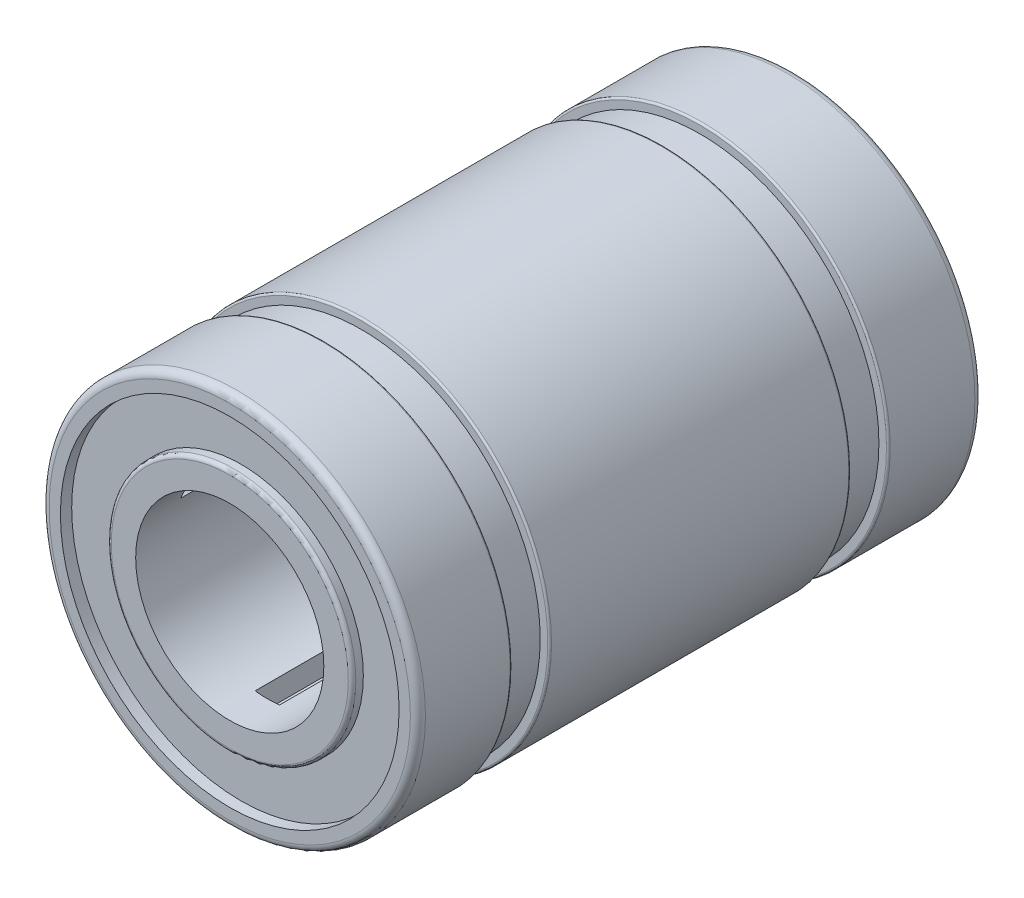
ISO-10303-21;
HEADER;
FILE_DESCRIPTION(('STEP AP214'),'2;1');
FILE_NAME('part.step','',(''),(''),'','','');
FILE_SCHEMA(('AUTOMOTIVE_DESIGN { 1 0 10303 214 1 1 1 1 }'));
ENDSEC;
DATA;
#1=APPLICATION_CONTEXT('core data for automotive mechanical design processes');
#2=APPLICATION_PROTOCOL_DEFINITION('international standard','automotive_design',2000,#1);
#3=PRODUCT_CONTEXT('',#1,'mechanical');
#4=PRODUCT('Part','Part','',(#3));
#5=PRODUCT_RELATED_PRODUCT_CATEGORY('part','',(#4));
#6=PRODUCT_DEFINITION_FORMATION('','',#4);
#7=PRODUCT_DEFINITION_CONTEXT('part definition',#1,'design');
#8=PRODUCT_DEFINITION('design','',#6,#7);
#9=PRODUCT_DEFINITION_SHAPE('','',#8);
#10=(LENGTH_UNIT() NAMED_UNIT(*) SI_UNIT(.MILLI.,.METRE.));
#11=(NAMED_UNIT(*) PLANE_ANGLE_UNIT() SI_UNIT($,.RADIAN.));
#12=(NAMED_UNIT(*) SI_UNIT($,.STERADIAN.) SOLID_ANGLE_UNIT());
#13=UNCERTAINTY_MEASURE_WITH_UNIT(LENGTH_MEASURE(1.E-05),#10,'distance_accuracy_value','');
#14=(GEOMETRIC_REPRESENTATION_CONTEXT(3) GLOBAL_UNCERTAINTY_ASSIGNED_CONTEXT((#13)) GLOBAL_UNIT_ASSIGNED_CONTEXT((#10,
#11,#12)) REPRESENTATION_CONTEXT('',''));
#15=CARTESIAN_POINT('',(0.,0.,0.));
#16=DIRECTION('',(0.,0.,1.));
#17=DIRECTION('',(1.,0.,0.));
#18=AXIS2_PLACEMENT_3D('',#15,#16,#17);
#19=CARTESIAN_POINT('',(-1.83838215350508,0.686207822560546,6.5));
#20=DIRECTION('',(-0.499999999999992,-0.866025403784443,0.));
#21=DIRECTION('',(0.866025403784443,-0.499999999999992,0.));
#22=AXIS2_PLACEMENT_3D('',#19,#20,#21);
#23=PLANE('',#22);
#24=DIRECTION('',(0.866025403784443,-0.499999999999992,0.));
#25=VECTOR('',#24,1.);
#26=CARTESIAN_POINT('',(-1.83838215350508,0.686207822560546,-6.5));
#27=LINE('',#26,#25);
#28=CARTESIAN_POINT('',(-2.81666253555662,1.25101826448092,-6.5));
#29=VERTEX_POINT('',#28);
#30=CARTESIAN_POINT('',(-2.30915894936689,0.958010932379585,-6.5));
#31=VERTEX_POINT('',#30);
#32=EDGE_CURVE('E175',#29,#31,#27,.T.);
#33=ORIENTED_EDGE('',*,*,#32,.F.);
#34=DIRECTION('',(0.,0.,-1.));
#35=VECTOR('',#34,1.);
#36=CARTESIAN_POINT('',(-2.81666253555662,1.25101826448092,6.5));
#37=LINE('',#36,#35);
#38=CARTESIAN_POINT('',(-2.81666253555662,1.25101826448092,6.5));
#39=VERTEX_POINT('',#38);
#40=EDGE_CURVE('E161',#39,#29,#37,.T.);
#41=ORIENTED_EDGE('',*,*,#40,.F.);
#42=DIRECTION('',(-0.866025403784443,0.499999999999992,0.));
#43=VECTOR('',#42,1.);
#44=CARTESIAN_POINT('',(-1.83838215350508,0.686207822560546,6.5));
#45=LINE('',#44,#43);
#46=CARTESIAN_POINT('',(-2.30915894936689,0.958010932379585,6.5));
#47=VERTEX_POINT('',#46);
#48=EDGE_CURVE('E177',#47,#39,#45,.T.);
#49=ORIENTED_EDGE('',*,*,#48,.F.);
#50=DIRECTION('',(0.,0.,-1.));
#51=VECTOR('',#50,1.);
#52=CARTESIAN_POINT('',(-2.30915894936689,0.958010932379585,12.8));
#53=LINE('',#52,#51);
#54=EDGE_CURVE('E53',#31,#47,#53,.F.);
#55=ORIENTED_EDGE('',*,*,#54,.F.);
#56=EDGE_LOOP('',(#33,#41,#49,#55));
#57=FACE_BOUND('',#56,.T.);
#58=ADVANCED_FACE('F38',(#57),#23,.F.);
#59=CARTESIAN_POINT('',(-1.5134644833656,1.24898173551904,6.5));
#60=DIRECTION('',(0.499999999999992,0.866025403784443,0.));
#61=DIRECTION('',(-0.866025403784443,0.499999999999992,0.));
#62=AXIS2_PLACEMENT_3D('',#59,#60,#61);
#63=PLANE('',#62);
#64=DIRECTION('',(-0.866025403784443,0.499999999999992,0.));
#65=VECTOR('',#64,1.);
#66=CARTESIAN_POINT('',(-1.5134644833656,1.24898173551904,-6.5));
#67=LINE('',#66,#65);
#68=CARTESIAN_POINT('',(-1.98424127922741,1.52078484533808,-6.5));
#69=VERTEX_POINT('',#68);
#70=CARTESIAN_POINT('',(-2.49174486541714,1.81379217743941,-6.5));
#71=VERTEX_POINT('',#70);
#72=EDGE_CURVE('E61',#69,#71,#67,.T.);
#73=ORIENTED_EDGE('',*,*,#72,.F.);
#74=DIRECTION('',(0.,0.,-1.));
#75=VECTOR('',#74,1.);
#76=CARTESIAN_POINT('',(-1.98424127922741,1.52078484533808,12.8));
#77=LINE('',#76,#75);
#78=CARTESIAN_POINT('',(-1.98424127922741,1.52078484533808,6.5));
#79=VERTEX_POINT('',#78);
#80=EDGE_CURVE('E221',#79,#69,#77,.T.);
#81=ORIENTED_EDGE('',*,*,#80,.F.);
#82=DIRECTION('',(0.866025403784443,-0.499999999999992,0.));
#83=VECTOR('',#82,1.);
#84=CARTESIAN_POINT('',(-1.5134644833656,1.24898173551904,6.5));
#85=LINE('',#84,#83);
#86=CARTESIAN_POINT('',(-2.49174486541714,1.81379217743941,6.5));
#87=VERTEX_POINT('',#86);
#88=EDGE_CURVE('E174',#87,#79,#85,.T.);
#89=ORIENTED_EDGE('',*,*,#88,.F.);
#90=DIRECTION('',(0.,0.,-1.));
#91=VECTOR('',#90,1.);
#92=CARTESIAN_POINT('',(-2.49174486541714,1.81379217743941,6.5));
#93=LINE('',#92,#91);
#94=EDGE_CURVE('E179',#87,#71,#93,.T.);
#95=ORIENTED_EDGE('',*,*,#94,.T.);
#96=EDGE_LOOP('',(#73,#81,#89,#95));
#97=FACE_BOUND('',#96,.T.);
#98=ADVANCED_FACE('F297',(#97),#63,.F.);
#99=CARTESIAN_POINT('',(-2.81666253555662,1.25101826448092,6.5));
#100=DIRECTION('',(-0.866025403784443,0.499999999999992,0.));
#101=DIRECTION('',(-0.499999999999992,-0.866025403784443,0.));
#102=AXIS2_PLACEMENT_3D('',#99,#100,#101);
#103=PLANE('',#102);
#104=DIRECTION('',(-0.499999999999992,-0.866025403784443,0.));
#105=VECTOR('',#104,1.);
#106=CARTESIAN_POINT('',(-2.81666253555662,1.25101826448092,-6.5));
#107=LINE('',#106,#105);
#108=EDGE_CURVE('E744',#71,#29,#107,.T.);
#109=ORIENTED_EDGE('',*,*,#108,.F.);
#110=ORIENTED_EDGE('',*,*,#94,.F.);
#111=DIRECTION('',(0.499999999999992,0.866025403784443,0.));
#112=VECTOR('',#111,1.);
#113=CARTESIAN_POINT('',(-2.81666253555662,1.25101826448092,6.5));
#114=LINE('',#113,#112);
#115=EDGE_CURVE('E171',#39,#87,#114,.T.);
#116=ORIENTED_EDGE('',*,*,#115,.F.);
#117=ORIENTED_EDGE('',*,*,#40,.T.);
#118=EDGE_LOOP('',(#109,#110,#116,#117));
#119=FACE_BOUND('',#118,.T.);
#120=ADVANCED_FACE('F302',(#119),#103,.F.);
#121=CARTESIAN_POINT('',(1.51346448336558,1.24898173551906,6.5));
#122=DIRECTION('',(-0.500000000000004,0.866025403784436,0.));
#123=DIRECTION('',(-0.866025403784436,-0.500000000000004,0.));
#124=AXIS2_PLACEMENT_3D('',#121,#122,#123);
#125=PLANE('',#124);
#126=DIRECTION('',(-0.866025403784436,-0.500000000000004,0.));
#127=VECTOR('',#126,1.);
#128=CARTESIAN_POINT('',(1.51346448336558,1.24898173551906,-6.5));
#129=LINE('',#128,#127);
#130=CARTESIAN_POINT('',(2.49174486541711,1.81379217743945,-6.5));
#131=VERTEX_POINT('',#130);
#132=CARTESIAN_POINT('',(1.98424127922739,1.52078484533811,-6.5));
#133=VERTEX_POINT('',#132);
#134=EDGE_CURVE('E741',#131,#133,#129,.T.);
#135=ORIENTED_EDGE('',*,*,#134,.F.);
#136=DIRECTION('',(0.,0.,-1.));
#137=VECTOR('',#136,1.);
#138=CARTESIAN_POINT('',(2.49174486541711,1.81379217743945,6.5));
#139=LINE('',#138,#137);
#140=CARTESIAN_POINT('',(2.49174486541711,1.81379217743945,6.5));
#141=VERTEX_POINT('',#140);
#142=EDGE_CURVE('E166',#141,#131,#139,.T.);
#143=ORIENTED_EDGE('',*,*,#142,.F.);
#144=DIRECTION('',(0.866025403784436,0.500000000000004,0.));
#145=VECTOR('',#144,1.);
#146=CARTESIAN_POINT('',(1.51346448336558,1.24898173551906,6.5));
#147=LINE('',#146,#145);
#148=CARTESIAN_POINT('',(1.98424127922739,1.52078484533811,6.5));
#149=VERTEX_POINT('',#148);
#150=EDGE_CURVE('E163',#149,#141,#147,.T.);
#151=ORIENTED_EDGE('',*,*,#150,.F.);
#152=DIRECTION('',(0.,0.,-1.));
#153=VECTOR('',#152,1.);
#154=CARTESIAN_POINT('',(1.98424127922739,1.52078484533811,12.8));
#155=LINE('',#154,#153);
#156=EDGE_CURVE('E230',#133,#149,#155,.F.);
#157=ORIENTED_EDGE('',*,*,#156,.F.);
#158=EDGE_LOOP('',(#135,#143,#151,#157));
#159=FACE_BOUND('',#158,.T.);
#160=ADVANCED_FACE('F310',(#159),#125,.F.);
#161=CARTESIAN_POINT('',(1.83838215350507,0.686207822560572,6.5));
#162=DIRECTION('',(0.500000000000004,-0.866025403784436,0.));
#163=DIRECTION('',(0.866025403784436,0.500000000000004,0.));
#164=AXIS2_PLACEMENT_3D('',#161,#162,#163);
#165=PLANE('',#164);
#166=DIRECTION('',(0.866025403784436,0.500000000000004,0.));
#167=VECTOR('',#166,1.);
#168=CARTESIAN_POINT('',(1.83838215350507,0.686207822560572,-6.5));
#169=LINE('',#168,#167);
#170=CARTESIAN_POINT('',(2.30915894936688,0.958010932379617,-6.5));
#171=VERTEX_POINT('',#170);
#172=CARTESIAN_POINT('',(2.8166625355566,1.25101826448096,-6.5));
#173=VERTEX_POINT('',#172);
#174=EDGE_CURVE('E738',#171,#173,#169,.T.);
#175=ORIENTED_EDGE('',*,*,#174,.F.);
#176=DIRECTION('',(0.,0.,-1.));
#177=VECTOR('',#176,1.);
#178=CARTESIAN_POINT('',(2.30915894936688,0.958010932379617,12.8));
#179=LINE('',#178,#177);
#180=CARTESIAN_POINT('',(2.30915894936688,0.958010932379617,6.5));
#181=VERTEX_POINT('',#180);
#182=EDGE_CURVE('E227',#181,#171,#179,.T.);
#183=ORIENTED_EDGE('',*,*,#182,.F.);
#184=DIRECTION('',(-0.866025403784436,-0.500000000000004,0.));
#185=VECTOR('',#184,1.);
#186=CARTESIAN_POINT('',(1.83838215350507,0.686207822560572,6.5));
#187=LINE('',#186,#185);
#188=CARTESIAN_POINT('',(2.8166625355566,1.25101826448096,6.5));
#189=VERTEX_POINT('',#188);
#190=EDGE_CURVE('E160',#189,#181,#187,.T.);
#191=ORIENTED_EDGE('',*,*,#190,.F.);
#192=DIRECTION('',(0.,0.,-1.));
#193=VECTOR('',#192,1.);
#194=CARTESIAN_POINT('',(2.8166625355566,1.25101826448096,6.5));
#195=LINE('',#194,#193);
#196=EDGE_CURVE('E165',#189,#173,#195,.T.);
#197=ORIENTED_EDGE('',*,*,#196,.T.);
#198=EDGE_LOOP('',(#175,#183,#191,#197));
#199=FACE_BOUND('',#198,.T.);
#200=ADVANCED_FACE('F619',(#199),#165,.F.);
#201=CARTESIAN_POINT('',(2.49174486541711,1.81379217743945,6.5));
#202=DIRECTION('',(0.866025403784436,0.500000000000004,0.));
#203=DIRECTION('',(-0.500000000000004,0.866025403784436,0.));
#204=AXIS2_PLACEMENT_3D('',#201,#202,#203);
#205=PLANE('',#204);
#206=DIRECTION('',(-0.500000000000004,0.866025403784436,0.));
#207=VECTOR('',#206,1.);
#208=CARTESIAN_POINT('',(2.49174486541711,1.81379217743945,-6.5));
#209=LINE('',#208,#207);
#210=EDGE_CURVE('E722',#173,#131,#209,.T.);
#211=ORIENTED_EDGE('',*,*,#210,.F.);
#212=ORIENTED_EDGE('',*,*,#196,.F.);
#213=DIRECTION('',(0.500000000000004,-0.866025403784436,0.));
#214=VECTOR('',#213,1.);
#215=CARTESIAN_POINT('',(2.49174486541711,1.81379217743945,6.5));
#216=LINE('',#215,#214);
#217=EDGE_CURVE('E157',#141,#189,#216,.T.);
#218=ORIENTED_EDGE('',*,*,#217,.F.);
#219=ORIENTED_EDGE('',*,*,#142,.T.);
#220=EDGE_LOOP('',(#211,#212,#218,#219));
#221=FACE_BOUND('',#220,.T.);
#222=ADVANCED_FACE('F628',(#221),#205,.F.);
#223=CARTESIAN_POINT('',(-0.324917670139485,-1.93518955807962,6.5));
#224=DIRECTION('',(-1.,0.,0.));
#225=DIRECTION('',(0.,0.,1.));
#226=AXIS2_PLACEMENT_3D('',#223,#224,#225);
#227=PLANE('',#226);
#228=DIRECTION('',(0.,-1.,0.));
#229=VECTOR('',#228,1.);
#230=CARTESIAN_POINT('',(-0.324917670139485,-1.93518955807962,-6.5));
#231=LINE('',#230,#229);
#232=CARTESIAN_POINT('',(-0.324917670139485,-2.47879577771771,-6.5));
#233=VERTEX_POINT('',#232);
#234=CARTESIAN_POINT('',(-0.324917670139485,-3.06481044192038,-6.5));
#235=VERTEX_POINT('',#234);
#236=EDGE_CURVE('E720',#233,#235,#231,.T.);
#237=ORIENTED_EDGE('',*,*,#236,.F.);
#238=DIRECTION('',(0.,0.,-1.));
#239=VECTOR('',#238,1.);
#240=CARTESIAN_POINT('',(-0.324917670139485,-2.47879577771771,12.8));
#241=LINE('',#240,#239);
#242=CARTESIAN_POINT('',(-0.324917670139485,-2.47879577771771,6.5));
#243=VERTEX_POINT('',#242);
#244=EDGE_CURVE('E235',#243,#233,#241,.T.);
#245=ORIENTED_EDGE('',*,*,#244,.F.);
#246=DIRECTION('',(0.,1.,0.));
#247=VECTOR('',#246,1.);
#248=CARTESIAN_POINT('',(-0.324917670139485,-1.93518955807962,6.5));
#249=LINE('',#248,#247);
#250=CARTESIAN_POINT('',(-0.324917670139485,-3.06481044192038,6.5));
#251=VERTEX_POINT('',#250);
#252=EDGE_CURVE('E138',#251,#243,#249,.T.);
#253=ORIENTED_EDGE('',*,*,#252,.F.);
#254=DIRECTION('',(0.,0.,-1.));
#255=VECTOR('',#254,1.);
#256=CARTESIAN_POINT('',(-0.324917670139485,-3.06481044192038,6.5));
#257=LINE('',#256,#255);
#258=EDGE_CURVE('E147',#251,#235,#257,.T.);
#259=ORIENTED_EDGE('',*,*,#258,.T.);
#260=EDGE_LOOP('',(#237,#245,#253,#259));
#261=FACE_BOUND('',#260,.T.);
#262=ADVANCED_FACE('F637',(#261),#227,.F.);
#263=CARTESIAN_POINT('',(0.324917670139485,-1.93518955807962,6.5));
#264=DIRECTION('',(1.,0.,0.));
#265=DIRECTION('',(0.,0.,-1.));
#266=AXIS2_PLACEMENT_3D('',#263,#264,#265);
#267=PLANE('',#266);
#268=DIRECTION('',(0.,1.,0.));
#269=VECTOR('',#268,1.);
#270=CARTESIAN_POINT('',(0.324917670139485,-1.93518955807962,-6.5));
#271=LINE('',#270,#269);
#272=CARTESIAN_POINT('',(0.324917670139485,-3.06481044192038,-6.5));
#273=VERTEX_POINT('',#272);
#274=CARTESIAN_POINT('',(0.324917670139485,-2.47879577771771,-6.5));
#275=VERTEX_POINT('',#274);
#276=EDGE_CURVE('E144',#273,#275,#271,.T.);
#277=ORIENTED_EDGE('',*,*,#276,.F.);
#278=DIRECTION('',(0.,0.,-1.));
#279=VECTOR('',#278,1.);
#280=CARTESIAN_POINT('',(0.324917670139485,-3.06481044192038,6.5));
#281=LINE('',#280,#279);
#282=CARTESIAN_POINT('',(0.324917670139485,-3.06481044192038,6.5));
#283=VERTEX_POINT('',#282);
#284=EDGE_CURVE('E141',#283,#273,#281,.T.);
#285=ORIENTED_EDGE('',*,*,#284,.F.);
#286=DIRECTION('',(0.,-1.,0.));
#287=VECTOR('',#286,1.);
#288=CARTESIAN_POINT('',(0.324917670139485,-1.93518955807962,6.5));
#289=LINE('',#288,#287);
#290=CARTESIAN_POINT('',(0.324917670139485,-2.47879577771771,6.5));
#291=VERTEX_POINT('',#290);
#292=EDGE_CURVE('E130',#291,#283,#289,.T.);
#293=ORIENTED_EDGE('',*,*,#292,.F.);
#294=DIRECTION('',(0.,0.,-1.));
#295=VECTOR('',#294,1.);
#296=CARTESIAN_POINT('',(0.324917670139485,-2.47879577771771,12.8));
#297=LINE('',#296,#295);
#298=EDGE_CURVE('E233',#275,#291,#297,.F.);
#299=ORIENTED_EDGE('',*,*,#298,.F.);
#300=EDGE_LOOP('',(#277,#285,#293,#299));
#301=FACE_BOUND('',#300,.T.);
#302=ADVANCED_FACE('F142',(#301),#267,.F.);
#303=CARTESIAN_POINT('',(0.324917670139485,-3.06481044192038,6.5));
#304=DIRECTION('',(0.,-1.,0.));
#305=DIRECTION('',(0.,0.,-1.));
#306=AXIS2_PLACEMENT_3D('',#303,#304,#305);
#307=PLANE('',#306);
#308=DIRECTION('',(1.,0.,0.));
#309=VECTOR('',#308,1.);
#310=CARTESIAN_POINT('',(0.324917670139485,-3.06481044192038,-6.5));
#311=LINE('',#310,#309);
#312=EDGE_CURVE('E238',#235,#273,#311,.T.);
#313=ORIENTED_EDGE('',*,*,#312,.F.);
#314=ORIENTED_EDGE('',*,*,#258,.F.);
#315=DIRECTION('',(-1.,0.,0.));
#316=VECTOR('',#315,1.);
#317=CARTESIAN_POINT('',(0.324917670139485,-3.06481044192038,6.5));
#318=LINE('',#317,#316);
#319=EDGE_CURVE('E134',#283,#251,#318,.T.);
#320=ORIENTED_EDGE('',*,*,#319,.F.);
#321=ORIENTED_EDGE('',*,*,#284,.T.);
#322=EDGE_LOOP('',(#313,#314,#320,#321));
#323=FACE_BOUND('',#322,.T.);
#324=ADVANCED_FACE('F149',(#323),#307,.F.);
#325=CARTESIAN_POINT('',(0.,0.,-4.));
#326=DIRECTION('',(0.,0.,1.));
#327=DIRECTION('',(1.,0.,0.));
#328=AXIS2_PLACEMENT_3D('',#325,#326,#327);
#329=CYLINDRICAL_SURFACE('',#328,5.);
#330=CARTESIAN_POINT('',(0.,0.,3.95));
#331=DIRECTION('',(0.,0.,1.));
#332=DIRECTION('',(1.,0.,0.));
#333=AXIS2_PLACEMENT_3D('',#330,#331,#332);
#334=CIRCLE('',#333,5.);
#335=CARTESIAN_POINT('',(5.,0.,3.95));
#336=VERTEX_POINT('',#335);
#337=EDGE_CURVE('E264',#336,#336,#334,.F.);
#338=ORIENTED_EDGE('',*,*,#337,.T.);
#339=EDGE_LOOP('',(#338));
#340=FACE_BOUND('',#339,.T.);
#341=CARTESIAN_POINT('',(0.,0.,-3.95));
#342=DIRECTION('',(0.,0.,1.));
#343=DIRECTION('',(1.,0.,0.));
#344=AXIS2_PLACEMENT_3D('',#341,#342,#343);
#345=CIRCLE('',#344,5.);
#346=CARTESIAN_POINT('',(5.,0.,-3.95));
#347=VERTEX_POINT('',#346);
#348=EDGE_CURVE('E261',#347,#347,#345,.T.);
#349=ORIENTED_EDGE('',*,*,#348,.T.);
#350=EDGE_LOOP('',(#349));
#351=FACE_BOUND('',#350,.T.);
#352=ADVANCED_FACE('F382',(#340,#351),#329,.T.);
#353=CARTESIAN_POINT('',(0.,0.,-4.));
#354=DIRECTION('',(0.,0.,1.));
#355=DIRECTION('',(1.,0.,0.));
#356=AXIS2_PLACEMENT_3D('',#353,#354,#355);
#357=PLANE('',#356);
#358=CARTESIAN_POINT('',(0.,0.,-4.));
#359=DIRECTION('',(0.,0.,1.));
#360=DIRECTION('',(1.,0.,0.));
#361=AXIS2_PLACEMENT_3D('',#358,#359,#360);
#362=CIRCLE('',#361,4.95);
#363=CARTESIAN_POINT('',(4.95,0.,-4.));
#364=VERTEX_POINT('',#363);
#365=EDGE_CURVE('E267',#364,#364,#362,.F.);
#366=ORIENTED_EDGE('',*,*,#365,.T.);
#367=EDGE_LOOP('',(#366));
#368=FACE_BOUND('',#367,.T.);
#369=CARTESIAN_POINT('',(0.,0.,-4.));
#370=DIRECTION('',(0.,0.,1.));
#371=DIRECTION('',(1.,0.,0.));
#372=AXIS2_PLACEMENT_3D('',#369,#370,#371);
#373=CIRCLE('',#372,4.75);
#374=CARTESIAN_POINT('',(4.75,0.,-4.));
#375=VERTEX_POINT('',#374);
#376=EDGE_CURVE('E208',#375,#375,#373,.T.);
#377=ORIENTED_EDGE('',*,*,#376,.T.);
#378=EDGE_LOOP('',(#377));
#379=FACE_BOUND('',#378,.T.);
#380=ADVANCED_FACE('F378',(#368,#379),#357,.F.);
#381=CARTESIAN_POINT('',(0.,0.,4.));
#382=DIRECTION('',(0.,0.,1.));
#383=DIRECTION('',(1.,0.,0.));
#384=AXIS2_PLACEMENT_3D('',#381,#382,#383);
#385=PLANE('',#384);
#386=CARTESIAN_POINT('',(0.,0.,4.));
#387=DIRECTION('',(0.,0.,1.));
#388=DIRECTION('',(1.,0.,0.));
#389=AXIS2_PLACEMENT_3D('',#386,#387,#388);
#390=CIRCLE('',#389,4.95);
#391=CARTESIAN_POINT('',(4.95,0.,4.));
#392=VERTEX_POINT('',#391);
#393=EDGE_CURVE('E258',#392,#392,#390,.T.);
#394=ORIENTED_EDGE('',*,*,#393,.T.);
#395=EDGE_LOOP('',(#394));
#396=FACE_BOUND('',#395,.T.);
#397=CARTESIAN_POINT('',(0.,0.,4.));
#398=DIRECTION('',(0.,0.,1.));
#399=DIRECTION('',(1.,0.,0.));
#400=AXIS2_PLACEMENT_3D('',#397,#398,#399);
#401=CIRCLE('',#400,4.75);
#402=CARTESIAN_POINT('',(4.75,0.,4.));
#403=VERTEX_POINT('',#402);
#404=EDGE_CURVE('E213',#403,#403,#401,.T.);
#405=ORIENTED_EDGE('',*,*,#404,.F.);
#406=EDGE_LOOP('',(#405));
#407=FACE_BOUND('',#406,.T.);
#408=ADVANCED_FACE('F374',(#396,#407),#385,.T.);
#409=CARTESIAN_POINT('',(0.,0.,-5.));
#410=DIRECTION('',(0.,0.,1.));
#411=DIRECTION('',(1.,0.,0.));
#412=AXIS2_PLACEMENT_3D('',#409,#410,#411);
#413=CYLINDRICAL_SURFACE('',#412,4.75);
#414=ORIENTED_EDGE('',*,*,#404,.T.);
#415=EDGE_LOOP('',(#414));
#416=FACE_BOUND('',#415,.T.);
#417=CARTESIAN_POINT('',(0.,0.,5.));
#418=DIRECTION('',(0.,0.,1.));
#419=DIRECTION('',(1.,0.,0.));
#420=AXIS2_PLACEMENT_3D('',#417,#418,#419);
#421=CIRCLE('',#420,4.75);
#422=CARTESIAN_POINT('',(4.75,0.,5.));
#423=VERTEX_POINT('',#422);
#424=EDGE_CURVE('E205',#423,#423,#421,.T.);
#425=ORIENTED_EDGE('',*,*,#424,.F.);
#426=EDGE_LOOP('',(#425));
#427=FACE_BOUND('',#426,.T.);
#428=ADVANCED_FACE('F371',(#416,#427),#413,.T.);
#429=CARTESIAN_POINT('',(0.,0.,-5.));
#430=DIRECTION('',(0.,0.,1.));
#431=DIRECTION('',(1.,0.,0.));
#432=AXIS2_PLACEMENT_3D('',#429,#430,#431);
#433=CIRCLE('',#432,4.75);
#434=CARTESIAN_POINT('',(4.75,0.,-5.));
#435=VERTEX_POINT('',#434);
#436=EDGE_CURVE('E202',#435,#435,#433,.T.);
#437=ORIENTED_EDGE('',*,*,#436,.T.);
#438=EDGE_LOOP('',(#437));
#439=FACE_BOUND('',#438,.T.);
#440=ORIENTED_EDGE('',*,*,#376,.F.);
#441=EDGE_LOOP('',(#440));
#442=FACE_BOUND('',#441,.T.);
#443=ADVANCED_FACE('F369',(#439,#442),#413,.T.);
#444=CARTESIAN_POINT('',(0.,0.,7.5));
#445=DIRECTION('',(0.,0.,-1.));
#446=DIRECTION('',(-1.,0.,0.));
#447=AXIS2_PLACEMENT_3D('',#444,#445,#446);
#448=CYLINDRICAL_SURFACE('',#447,5.);
#449=CARTESIAN_POINT('',(0.,0.,5.05));
#450=DIRECTION('',(0.,0.,1.));
#451=DIRECTION('',(1.,0.,0.));
#452=AXIS2_PLACEMENT_3D('',#449,#450,#451);
#453=CIRCLE('',#452,5.);
#454=CARTESIAN_POINT('',(5.,0.,5.05));
#455=VERTEX_POINT('',#454);
#456=EDGE_CURVE('E252',#455,#455,#453,.T.);
#457=ORIENTED_EDGE('',*,*,#456,.T.);
#458=EDGE_LOOP('',(#457));
#459=FACE_BOUND('',#458,.T.);
#460=CARTESIAN_POINT('',(0.,0.,7.3));
#461=DIRECTION('',(0.,0.,1.));
#462=DIRECTION('',(1.,0.,0.));
#463=AXIS2_PLACEMENT_3D('',#460,#461,#462);
#464=CIRCLE('',#463,5.);
#465=CARTESIAN_POINT('',(5.,0.,7.3));
#466=VERTEX_POINT('',#465);
#467=EDGE_CURVE('E243',#466,#466,#464,.F.);
#468=ORIENTED_EDGE('',*,*,#467,.T.);
#469=EDGE_LOOP('',(#468));
#470=FACE_BOUND('',#469,.T.);
#471=ADVANCED_FACE('F362',(#459,#470),#448,.T.);
#472=CARTESIAN_POINT('',(0.,0.,7.5));
#473=DIRECTION('',(0.,0.,1.));
#474=DIRECTION('',(1.,0.,0.));
#475=AXIS2_PLACEMENT_3D('',#472,#473,#474);
#476=PLANE('',#475);
#477=CARTESIAN_POINT('',(0.,0.,7.5));
#478=DIRECTION('',(0.,0.,1.));
#479=DIRECTION('',(1.,0.,0.));
#480=AXIS2_PLACEMENT_3D('',#477,#478,#479);
#481=CIRCLE('',#480,4.8);
#482=CARTESIAN_POINT('',(4.8,0.,7.5));
#483=VERTEX_POINT('',#482);
#484=EDGE_CURVE('E240',#483,#483,#481,.T.);
#485=ORIENTED_EDGE('',*,*,#484,.T.);
#486=EDGE_LOOP('',(#485));
#487=FACE_BOUND('',#486,.T.);
#488=CARTESIAN_POINT('',(0.,0.,7.5));
#489=DIRECTION('',(0.,0.,1.));
#490=DIRECTION('',(1.,0.,0.));
#491=AXIS2_PLACEMENT_3D('',#488,#489,#490);
#492=CIRCLE('',#491,4.5);
#493=CARTESIAN_POINT('',(4.5,0.,7.5));
#494=VERTEX_POINT('',#493);
#495=EDGE_CURVE('E196',#494,#494,#492,.T.);
#496=ORIENTED_EDGE('',*,*,#495,.F.);
#497=EDGE_LOOP('',(#496));
#498=FACE_BOUND('',#497,.T.);
#499=ADVANCED_FACE('F359',(#487,#498),#476,.T.);
#500=CARTESIAN_POINT('',(0.,0.,5.));
#501=DIRECTION('',(0.,0.,1.));
#502=DIRECTION('',(1.,0.,0.));
#503=AXIS2_PLACEMENT_3D('',#500,#501,#502);
#504=PLANE('',#503);
#505=CARTESIAN_POINT('',(0.,0.,5.));
#506=DIRECTION('',(0.,0.,1.));
#507=DIRECTION('',(1.,0.,0.));
#508=AXIS2_PLACEMENT_3D('',#505,#506,#507);
#509=CIRCLE('',#508,4.95);
#510=CARTESIAN_POINT('',(4.95,0.,5.));
#511=VERTEX_POINT('',#510);
#512=EDGE_CURVE('E255',#511,#511,#509,.F.);
#513=ORIENTED_EDGE('',*,*,#512,.T.);
#514=EDGE_LOOP('',(#513));
#515=FACE_BOUND('',#514,.T.);
#516=ORIENTED_EDGE('',*,*,#424,.T.);
#517=EDGE_LOOP('',(#516));
#518=FACE_BOUND('',#517,.T.);
#519=ADVANCED_FACE('F357',(#515,#518),#504,.F.);
#520=CARTESIAN_POINT('',(0.,0.,-7.5));
#521=DIRECTION('',(0.,0.,1.));
#522=DIRECTION('',(1.,0.,0.));
#523=AXIS2_PLACEMENT_3D('',#520,#521,#522);
#524=CYLINDRICAL_SURFACE('',#523,5.);
#525=CARTESIAN_POINT('',(0.,0.,-5.05));
#526=DIRECTION('',(0.,0.,-1.));
#527=DIRECTION('',(-1.,0.,0.));
#528=AXIS2_PLACEMENT_3D('',#525,#526,#527);
#529=CIRCLE('',#528,5.);
#530=CARTESIAN_POINT('',(-5.,0.,-5.05));
#531=VERTEX_POINT('',#530);
#532=EDGE_CURVE('E270',#531,#531,#529,.T.);
#533=ORIENTED_EDGE('',*,*,#532,.T.);
#534=EDGE_LOOP('',(#533));
#535=FACE_BOUND('',#534,.T.);
#536=CARTESIAN_POINT('',(0.,0.,-7.3));
#537=DIRECTION('',(0.,0.,-1.));
#538=DIRECTION('',(-1.,0.,0.));
#539=AXIS2_PLACEMENT_3D('',#536,#537,#538);
#540=CIRCLE('',#539,5.);
#541=CARTESIAN_POINT('',(-5.,0.,-7.3));
#542=VERTEX_POINT('',#541);
#543=EDGE_CURVE('E249',#542,#542,#540,.F.);
#544=ORIENTED_EDGE('',*,*,#543,.T.);
#545=EDGE_LOOP('',(#544));
#546=FACE_BOUND('',#545,.T.);
#547=ADVANCED_FACE('F350',(#535,#546),#524,.T.);
#548=CARTESIAN_POINT('',(0.,0.,-7.5));
#549=DIRECTION('',(0.,0.,-1.));
#550=DIRECTION('',(-1.,0.,0.));
#551=AXIS2_PLACEMENT_3D('',#548,#549,#550);
#552=PLANE('',#551);
#553=CARTESIAN_POINT('',(0.,0.,-7.5));
#554=DIRECTION('',(0.,0.,-1.));
#555=DIRECTION('',(-1.,0.,0.));
#556=AXIS2_PLACEMENT_3D('',#553,#554,#555);
#557=CIRCLE('',#556,4.8);
#558=CARTESIAN_POINT('',(-4.8,0.,-7.5));
#559=VERTEX_POINT('',#558);
#560=EDGE_CURVE('E246',#559,#559,#557,.T.);
#561=ORIENTED_EDGE('',*,*,#560,.T.);
#562=EDGE_LOOP('',(#561));
#563=FACE_BOUND('',#562,.T.);
#564=CARTESIAN_POINT('',(0.,0.,-7.5));
#565=DIRECTION('',(0.,0.,-1.));
#566=DIRECTION('',(-1.,0.,0.));
#567=AXIS2_PLACEMENT_3D('',#564,#565,#566);
#568=CIRCLE('',#567,4.5);
#569=CARTESIAN_POINT('',(-4.5,0.,-7.5));
#570=VERTEX_POINT('',#569);
#571=EDGE_CURVE('E192',#570,#570,#568,.T.);
#572=ORIENTED_EDGE('',*,*,#571,.F.);
#573=EDGE_LOOP('',(#572));
#574=FACE_BOUND('',#573,.T.);
#575=ADVANCED_FACE('F347',(#563,#574),#552,.T.);
#576=CARTESIAN_POINT('',(0.,0.,-5.));
#577=DIRECTION('',(0.,0.,-1.));
#578=DIRECTION('',(-1.,0.,0.));
#579=AXIS2_PLACEMENT_3D('',#576,#577,#578);
#580=PLANE('',#579);
#581=CARTESIAN_POINT('',(0.,0.,-5.));
#582=DIRECTION('',(0.,0.,-1.));
#583=DIRECTION('',(-1.,0.,0.));
#584=AXIS2_PLACEMENT_3D('',#581,#582,#583);
#585=CIRCLE('',#584,4.95);
#586=CARTESIAN_POINT('',(-4.95,0.,-5.));
#587=VERTEX_POINT('',#586);
#588=EDGE_CURVE('E273',#587,#587,#585,.F.);
#589=ORIENTED_EDGE('',*,*,#588,.T.);
#590=EDGE_LOOP('',(#589));
#591=FACE_BOUND('',#590,.T.);
#592=ORIENTED_EDGE('',*,*,#436,.F.);
#593=EDGE_LOOP('',(#592));
#594=FACE_BOUND('',#593,.T.);
#595=ADVANCED_FACE('F345',(#591,#594),#580,.F.);
#596=CARTESIAN_POINT('',(0.,0.,7.2));
#597=DIRECTION('',(0.,0.,1.));
#598=DIRECTION('',(1.,0.,0.));
#599=AXIS2_PLACEMENT_3D('',#596,#597,#598);
#600=CYLINDRICAL_SURFACE('',#599,4.5);
#601=CARTESIAN_POINT('',(0.,0.,7.2));
#602=DIRECTION('',(0.,0.,1.));
#603=DIRECTION('',(1.,0.,0.));
#604=AXIS2_PLACEMENT_3D('',#601,#602,#603);
#605=CIRCLE('',#604,4.5);
#606=CARTESIAN_POINT('',(4.5,0.,7.2));
#607=VERTEX_POINT('',#606);
#608=EDGE_CURVE('E199',#607,#607,#605,.T.);
#609=ORIENTED_EDGE('',*,*,#608,.F.);
#610=EDGE_LOOP('',(#609));
#611=FACE_BOUND('',#610,.T.);
#612=ORIENTED_EDGE('',*,*,#495,.T.);
#613=EDGE_LOOP('',(#612));
#614=FACE_BOUND('',#613,.T.);
#615=ADVANCED_FACE('F341',(#611,#614),#600,.F.);
#616=CARTESIAN_POINT('',(0.,0.,7.2));
#617=DIRECTION('',(0.,0.,1.));
#618=DIRECTION('',(1.,0.,0.));
#619=AXIS2_PLACEMENT_3D('',#616,#617,#618);
#620=PLANE('',#619);
#621=CARTESIAN_POINT('',(0.,0.,7.2));
#622=DIRECTION('',(0.,0.,1.));
#623=DIRECTION('',(1.,0.,0.));
#624=AXIS2_PLACEMENT_3D('',#621,#622,#623);
#625=CIRCLE('',#624,3.25);
#626=CARTESIAN_POINT('',(3.25,0.,7.2));
#627=VERTEX_POINT('',#626);
#628=EDGE_CURVE('E186',#627,#627,#625,.T.);
#629=ORIENTED_EDGE('',*,*,#628,.F.);
#630=EDGE_LOOP('',(#629));
#631=FACE_BOUND('',#630,.T.);
#632=ORIENTED_EDGE('',*,*,#608,.T.);
#633=EDGE_LOOP('',(#632));
#634=FACE_BOUND('',#633,.T.);
#635=ADVANCED_FACE('F337',(#631,#634),#620,.T.);
#636=CARTESIAN_POINT('',(0.,0.,-7.2));
#637=DIRECTION('',(0.,0.,-1.));
#638=DIRECTION('',(-1.,0.,0.));
#639=AXIS2_PLACEMENT_3D('',#636,#637,#638);
#640=CYLINDRICAL_SURFACE('',#639,4.5);
#641=CARTESIAN_POINT('',(0.,0.,-7.2));
#642=DIRECTION('',(0.,0.,-1.));
#643=DIRECTION('',(-1.,0.,0.));
#644=AXIS2_PLACEMENT_3D('',#641,#642,#643);
#645=CIRCLE('',#644,4.5);
#646=CARTESIAN_POINT('',(-4.5,0.,-7.2));
#647=VERTEX_POINT('',#646);
#648=EDGE_CURVE('E193',#647,#647,#645,.T.);
#649=ORIENTED_EDGE('',*,*,#648,.F.);
#650=EDGE_LOOP('',(#649));
#651=FACE_BOUND('',#650,.T.);
#652=ORIENTED_EDGE('',*,*,#571,.T.);
#653=EDGE_LOOP('',(#652));
#654=FACE_BOUND('',#653,.T.);
#655=ADVANCED_FACE('F333',(#651,#654),#640,.F.);
#656=CARTESIAN_POINT('',(0.,0.,-7.2));
#657=DIRECTION('',(0.,0.,-1.));
#658=DIRECTION('',(-1.,0.,0.));
#659=AXIS2_PLACEMENT_3D('',#656,#657,#658);
#660=PLANE('',#659);
#661=CARTESIAN_POINT('',(0.,0.,-7.2));
#662=DIRECTION('',(0.,0.,-1.));
#663=DIRECTION('',(-1.,0.,0.));
#664=AXIS2_PLACEMENT_3D('',#661,#662,#663);
#665=CIRCLE('',#664,3.25);
#666=CARTESIAN_POINT('',(-3.25,0.,-7.2));
#667=VERTEX_POINT('',#666);
#668=EDGE_CURVE('E189',#667,#667,#665,.T.);
#669=ORIENTED_EDGE('',*,*,#668,.F.);
#670=EDGE_LOOP('',(#669));
#671=FACE_BOUND('',#670,.T.);
#672=ORIENTED_EDGE('',*,*,#648,.T.);
#673=EDGE_LOOP('',(#672));
#674=FACE_BOUND('',#673,.T.);
#675=ADVANCED_FACE('F329',(#671,#674),#660,.T.);
#676=CARTESIAN_POINT('',(0.,0.,-7.5));
#677=DIRECTION('',(0.,0.,1.));
#678=DIRECTION('',(1.,0.,0.));
#679=AXIS2_PLACEMENT_3D('',#676,#677,#678);
#680=CYLINDRICAL_SURFACE('',#679,3.25);
#681=CARTESIAN_POINT('',(0.,0.,-7.4));
#682=DIRECTION('',(0.,0.,-1.));
#683=DIRECTION('',(-1.,0.,0.));
#684=AXIS2_PLACEMENT_3D('',#681,#682,#683);
#685=CIRCLE('',#684,3.25);
#686=CARTESIAN_POINT('',(-3.25,0.,-7.4));
#687=VERTEX_POINT('',#686);
#688=EDGE_CURVE('E11',#687,#687,#685,.F.);
#689=ORIENTED_EDGE('',*,*,#688,.T.);
#690=EDGE_LOOP('',(#689));
#691=FACE_BOUND('',#690,.T.);
#692=ORIENTED_EDGE('',*,*,#668,.T.);
#693=EDGE_LOOP('',(#692));
#694=FACE_BOUND('',#693,.T.);
#695=ADVANCED_FACE('F326',(#691,#694),#680,.T.);
#696=CARTESIAN_POINT('',(0.,0.,-7.5));
#697=DIRECTION('',(0.,0.,-1.));
#698=DIRECTION('',(-1.,0.,0.));
#699=AXIS2_PLACEMENT_3D('',#696,#697,#698);
#700=PLANE('',#699);
#701=CARTESIAN_POINT('',(0.,0.,-7.5));
#702=DIRECTION('',(0.,0.,-1.));
#703=DIRECTION('',(-1.,0.,0.));
#704=AXIS2_PLACEMENT_3D('',#701,#702,#703);
#705=CIRCLE('',#704,3.15);
#706=CARTESIAN_POINT('',(-3.15,0.,-7.5));
#707=VERTEX_POINT('',#706);
#708=EDGE_CURVE('E46',#707,#707,#705,.T.);
#709=ORIENTED_EDGE('',*,*,#708,.T.);
#710=EDGE_LOOP('',(#709));
#711=FACE_BOUND('',#710,.T.);
#712=CARTESIAN_POINT('',(0.,0.,-7.5));
#713=DIRECTION('',(0.,0.,-1.));
#714=DIRECTION('',(-1.,0.,0.));
#715=AXIS2_PLACEMENT_3D('',#712,#713,#714);
#716=CIRCLE('',#715,2.5);
#717=CARTESIAN_POINT('',(-2.5,0.,-7.5));
#718=VERTEX_POINT('',#717);
#719=EDGE_CURVE('E155',#718,#718,#716,.T.);
#720=ORIENTED_EDGE('',*,*,#719,.F.);
#721=EDGE_LOOP('',(#720));
#722=FACE_BOUND('',#721,.T.);
#723=ADVANCED_FACE('F284',(#711,#722),#700,.T.);
#724=CARTESIAN_POINT('',(0.,0.,7.5));
#725=DIRECTION('',(0.,0.,-1.));
#726=DIRECTION('',(-1.,0.,0.));
#727=AXIS2_PLACEMENT_3D('',#724,#725,#726);
#728=CYLINDRICAL_SURFACE('',#727,3.25);
#729=CARTESIAN_POINT('',(0.,0.,7.4));
#730=DIRECTION('',(0.,0.,1.));
#731=DIRECTION('',(1.,0.,0.));
#732=AXIS2_PLACEMENT_3D('',#729,#730,#731);
#733=CIRCLE('',#732,3.25);
#734=CARTESIAN_POINT('',(3.25,0.,7.4));
#735=VERTEX_POINT('',#734);
#736=EDGE_CURVE('E279',#735,#735,#733,.F.);
#737=ORIENTED_EDGE('',*,*,#736,.T.);
#738=EDGE_LOOP('',(#737));
#739=FACE_BOUND('',#738,.T.);
#740=ORIENTED_EDGE('',*,*,#628,.T.);
#741=EDGE_LOOP('',(#740));
#742=FACE_BOUND('',#741,.T.);
#743=ADVANCED_FACE('F319',(#739,#742),#728,.T.);
#744=CARTESIAN_POINT('',(0.,0.,7.5));
#745=DIRECTION('',(0.,0.,1.));
#746=DIRECTION('',(1.,0.,0.));
#747=AXIS2_PLACEMENT_3D('',#744,#745,#746);
#748=PLANE('',#747);
#749=CARTESIAN_POINT('',(0.,0.,7.5));
#750=DIRECTION('',(0.,0.,1.));
#751=DIRECTION('',(1.,0.,0.));
#752=AXIS2_PLACEMENT_3D('',#749,#750,#751);
#753=CIRCLE('',#752,3.15);
#754=CARTESIAN_POINT('',(3.15,0.,7.5));
#755=VERTEX_POINT('',#754);
#756=EDGE_CURVE('E276',#755,#755,#753,.T.);
#757=ORIENTED_EDGE('',*,*,#756,.T.);
#758=EDGE_LOOP('',(#757));
#759=FACE_BOUND('',#758,.T.);
#760=CARTESIAN_POINT('',(0.,0.,7.5));
#761=DIRECTION('',(0.,0.,1.));
#762=DIRECTION('',(1.,0.,0.));
#763=AXIS2_PLACEMENT_3D('',#760,#761,#762);
#764=CIRCLE('',#763,2.5);
#765=CARTESIAN_POINT('',(2.5,0.,7.5));
#766=VERTEX_POINT('',#765);
#767=EDGE_CURVE('E185',#766,#766,#764,.T.);
#768=ORIENTED_EDGE('',*,*,#767,.F.);
#769=EDGE_LOOP('',(#768));
#770=FACE_BOUND('',#769,.T.);
#771=ADVANCED_FACE('F315',(#759,#770),#748,.T.);
#772=CARTESIAN_POINT('',(0.,0.,12.8));
#773=DIRECTION('',(0.,0.,-1.));
#774=DIRECTION('',(-1.,0.,0.));
#775=AXIS2_PLACEMENT_3D('',#772,#773,#774);
#776=CYLINDRICAL_SURFACE('',#775,2.5);
#777=ORIENTED_EDGE('',*,*,#182,.T.);
#778=CARTESIAN_POINT('',(0.,0.,-6.5));
#779=DIRECTION('',(0.,0.,-1.));
#780=DIRECTION('',(-1.,0.,0.));
#781=AXIS2_PLACEMENT_3D('',#778,#779,#780);
#782=CIRCLE('',#781,2.5);
#783=EDGE_CURVE('E728',#133,#171,#782,.T.);
#784=ORIENTED_EDGE('',*,*,#783,.F.);
#785=ORIENTED_EDGE('',*,*,#156,.T.);
#786=CARTESIAN_POINT('',(0.,0.,6.5));
#787=DIRECTION('',(0.,0.,1.));
#788=DIRECTION('',(1.,0.,0.));
#789=AXIS2_PLACEMENT_3D('',#786,#787,#788);
#790=CIRCLE('',#789,2.5);
#791=EDGE_CURVE('E224',#149,#181,#790,.F.);
#792=ORIENTED_EDGE('',*,*,#791,.T.);
#793=EDGE_LOOP('',(#777,#784,#785,#792));
#794=FACE_BOUND('',#793,.T.);
#795=ORIENTED_EDGE('',*,*,#80,.T.);
#796=EDGE_CURVE('E730',#31,#69,#782,.T.);
#797=ORIENTED_EDGE('',*,*,#796,.F.);
#798=ORIENTED_EDGE('',*,*,#54,.T.);
#799=CARTESIAN_POINT('',(0.,0.,6.5));
#800=DIRECTION('',(0.,0.,1.));
#801=DIRECTION('',(1.,0.,0.));
#802=AXIS2_PLACEMENT_3D('',#799,#800,#801);
#803=CIRCLE('',#802,2.5);
#804=EDGE_CURVE('E216',#47,#79,#803,.F.);
#805=ORIENTED_EDGE('',*,*,#804,.T.);
#806=EDGE_LOOP('',(#795,#797,#798,#805));
#807=FACE_BOUND('',#806,.T.);
#808=EDGE_CURVE('E727',#275,#233,#782,.T.);
#809=ORIENTED_EDGE('',*,*,#808,.F.);
#810=ORIENTED_EDGE('',*,*,#298,.T.);
#811=CARTESIAN_POINT('',(0.,0.,6.5));
#812=DIRECTION('',(0.,0.,-1.));
#813=DIRECTION('',(-1.,0.,0.));
#814=AXIS2_PLACEMENT_3D('',#811,#812,#813);
#815=CIRCLE('',#814,2.5);
#816=EDGE_CURVE('E136',#243,#291,#815,.F.);
#817=ORIENTED_EDGE('',*,*,#816,.F.);
#818=ORIENTED_EDGE('',*,*,#244,.T.);
#819=EDGE_LOOP('',(#809,#810,#817,#818));
#820=FACE_BOUND('',#819,.T.);
#821=ORIENTED_EDGE('',*,*,#719,.T.);
#822=EDGE_LOOP('',(#821));
#823=FACE_BOUND('',#822,.T.);
#824=ORIENTED_EDGE('',*,*,#767,.T.);
#825=EDGE_LOOP('',(#824));
#826=FACE_BOUND('',#825,.T.);
#827=ADVANCED_FACE('F312',(#794,#807,#820,#823,#826),#776,.F.);
#828=CARTESIAN_POINT('',(0.,0.,6.5));
#829=DIRECTION('',(0.,0.,1.));
#830=DIRECTION('',(1.,0.,0.));
#831=AXIS2_PLACEMENT_3D('',#828,#829,#830);
#832=PLANE('',#831);
#833=ORIENTED_EDGE('',*,*,#48,.T.);
#834=ORIENTED_EDGE('',*,*,#115,.T.);
#835=ORIENTED_EDGE('',*,*,#88,.T.);
#836=ORIENTED_EDGE('',*,*,#804,.F.);
#837=EDGE_LOOP('',(#833,#834,#835,#836));
#838=FACE_BOUND('',#837,.T.);
#839=ADVANCED_FACE('F305',(#838),#832,.F.);
#840=CARTESIAN_POINT('',(0.,0.,6.5));
#841=DIRECTION('',(0.,0.,1.));
#842=DIRECTION('',(1.,0.,0.));
#843=AXIS2_PLACEMENT_3D('',#840,#841,#842);
#844=PLANE('',#843);
#845=ORIENTED_EDGE('',*,*,#150,.T.);
#846=ORIENTED_EDGE('',*,*,#217,.T.);
#847=ORIENTED_EDGE('',*,*,#190,.T.);
#848=ORIENTED_EDGE('',*,*,#791,.F.);
#849=EDGE_LOOP('',(#845,#846,#847,#848));
#850=FACE_BOUND('',#849,.T.);
#851=ADVANCED_FACE('F506',(#850),#844,.F.);
#852=CARTESIAN_POINT('',(0.,0.,6.5));
#853=DIRECTION('',(0.,0.,-1.));
#854=DIRECTION('',(-1.,0.,0.));
#855=AXIS2_PLACEMENT_3D('',#852,#853,#854);
#856=PLANE('',#855);
#857=ORIENTED_EDGE('',*,*,#816,.T.);
#858=ORIENTED_EDGE('',*,*,#292,.T.);
#859=ORIENTED_EDGE('',*,*,#319,.T.);
#860=ORIENTED_EDGE('',*,*,#252,.T.);
#861=EDGE_LOOP('',(#857,#858,#859,#860));
#862=FACE_BOUND('',#861,.T.);
#863=ADVANCED_FACE('F132',(#862),#856,.T.);
#864=CARTESIAN_POINT('',(0.,0.,-6.5));
#865=DIRECTION('',(0.,0.,-1.));
#866=DIRECTION('',(-1.,0.,0.));
#867=AXIS2_PLACEMENT_3D('',#864,#865,#866);
#868=PLANE('',#867);
#869=ORIENTED_EDGE('',*,*,#808,.T.);
#870=ORIENTED_EDGE('',*,*,#236,.T.);
#871=ORIENTED_EDGE('',*,*,#312,.T.);
#872=ORIENTED_EDGE('',*,*,#276,.T.);
#873=EDGE_LOOP('',(#869,#870,#871,#872));
#874=FACE_BOUND('',#873,.T.);
#875=ADVANCED_FACE('F520',(#874),#868,.F.);
#876=ORIENTED_EDGE('',*,*,#210,.T.);
#877=ORIENTED_EDGE('',*,*,#134,.T.);
#878=ORIENTED_EDGE('',*,*,#783,.T.);
#879=ORIENTED_EDGE('',*,*,#174,.T.);
#880=EDGE_LOOP('',(#876,#877,#878,#879));
#881=FACE_BOUND('',#880,.T.);
#882=ADVANCED_FACE('F526',(#881),#868,.F.);
#883=ORIENTED_EDGE('',*,*,#108,.T.);
#884=ORIENTED_EDGE('',*,*,#32,.T.);
#885=ORIENTED_EDGE('',*,*,#796,.T.);
#886=ORIENTED_EDGE('',*,*,#72,.T.);
#887=EDGE_LOOP('',(#883,#884,#885,#886));
#888=FACE_BOUND('',#887,.T.);
#889=ADVANCED_FACE('F391',(#888),#868,.F.);
#890=CARTESIAN_POINT('',(0.,0.,7.3));
#891=DIRECTION('',(0.,0.,1.));
#892=DIRECTION('',(1.,0.,0.));
#893=AXIS2_PLACEMENT_3D('',#890,#891,#892);
#894=TOROIDAL_SURFACE('',#893,4.8,0.2);
#895=ORIENTED_EDGE('',*,*,#467,.F.);
#896=EDGE_LOOP('',(#895));
#897=FACE_BOUND('',#896,.T.);
#898=ORIENTED_EDGE('',*,*,#484,.F.);
#899=EDGE_LOOP('',(#898));
#900=FACE_BOUND('',#899,.T.);
#901=ADVANCED_FACE('F387',(#897,#900),#894,.T.);
#902=CARTESIAN_POINT('',(0.,0.,-7.3));
#903=DIRECTION('',(0.,0.,-1.));
#904=DIRECTION('',(-1.,0.,0.));
#905=AXIS2_PLACEMENT_3D('',#902,#903,#904);
#906=TOROIDAL_SURFACE('',#905,4.8,0.2);
#907=ORIENTED_EDGE('',*,*,#543,.F.);
#908=EDGE_LOOP('',(#907));
#909=FACE_BOUND('',#908,.T.);
#910=ORIENTED_EDGE('',*,*,#560,.F.);
#911=EDGE_LOOP('',(#910));
#912=FACE_BOUND('',#911,.T.);
#913=ADVANCED_FACE('F390',(#909,#912),#906,.T.);
#914=CARTESIAN_POINT('',(0.,0.,5.05));
#915=DIRECTION('',(0.,0.,1.));
#916=DIRECTION('',(1.,0.,0.));
#917=AXIS2_PLACEMENT_3D('',#914,#915,#916);
#918=TOROIDAL_SURFACE('',#917,4.95,0.05);
#919=ORIENTED_EDGE('',*,*,#512,.F.);
#920=EDGE_LOOP('',(#919));
#921=FACE_BOUND('',#920,.T.);
#922=ORIENTED_EDGE('',*,*,#456,.F.);
#923=EDGE_LOOP('',(#922));
#924=FACE_BOUND('',#923,.T.);
#925=ADVANCED_FACE('F395',(#921,#924),#918,.T.);
#926=CARTESIAN_POINT('',(0.,0.,3.95));
#927=DIRECTION('',(0.,0.,1.));
#928=DIRECTION('',(1.,0.,0.));
#929=AXIS2_PLACEMENT_3D('',#926,#927,#928);
#930=TOROIDAL_SURFACE('',#929,4.95,0.05);
#931=ORIENTED_EDGE('',*,*,#337,.F.);
#932=EDGE_LOOP('',(#931));
#933=FACE_BOUND('',#932,.T.);
#934=ORIENTED_EDGE('',*,*,#393,.F.);
#935=EDGE_LOOP('',(#934));
#936=FACE_BOUND('',#935,.T.);
#937=ADVANCED_FACE('F399',(#933,#936),#930,.T.);
#938=CARTESIAN_POINT('',(0.,0.,-3.95));
#939=DIRECTION('',(0.,0.,1.));
#940=DIRECTION('',(1.,0.,0.));
#941=AXIS2_PLACEMENT_3D('',#938,#939,#940);
#942=TOROIDAL_SURFACE('',#941,4.95,0.05);
#943=ORIENTED_EDGE('',*,*,#365,.F.);
#944=EDGE_LOOP('',(#943));
#945=FACE_BOUND('',#944,.T.);
#946=ORIENTED_EDGE('',*,*,#348,.F.);
#947=EDGE_LOOP('',(#946));
#948=FACE_BOUND('',#947,.T.);
#949=ADVANCED_FACE('F403',(#945,#948),#942,.T.);
#950=CARTESIAN_POINT('',(0.,0.,-5.05));
#951=DIRECTION('',(0.,0.,-1.));
#952=DIRECTION('',(-1.,0.,0.));
#953=AXIS2_PLACEMENT_3D('',#950,#951,#952);
#954=TOROIDAL_SURFACE('',#953,4.95,0.05);
#955=ORIENTED_EDGE('',*,*,#588,.F.);
#956=EDGE_LOOP('',(#955));
#957=FACE_BOUND('',#956,.T.);
#958=ORIENTED_EDGE('',*,*,#532,.F.);
#959=EDGE_LOOP('',(#958));
#960=FACE_BOUND('',#959,.T.);
#961=ADVANCED_FACE('F293',(#957,#960),#954,.T.);
#962=CARTESIAN_POINT('',(0.,0.,7.4));
#963=DIRECTION('',(0.,0.,1.));
#964=DIRECTION('',(1.,0.,0.));
#965=AXIS2_PLACEMENT_3D('',#962,#963,#964);
#966=TOROIDAL_SURFACE('',#965,3.15,0.1);
#967=ORIENTED_EDGE('',*,*,#736,.F.);
#968=EDGE_LOOP('',(#967));
#969=FACE_BOUND('',#968,.T.);
#970=ORIENTED_EDGE('',*,*,#756,.F.);
#971=EDGE_LOOP('',(#970));
#972=FACE_BOUND('',#971,.T.);
#973=ADVANCED_FACE('F288',(#969,#972),#966,.T.);
#974=CARTESIAN_POINT('',(0.,0.,-7.4));
#975=DIRECTION('',(0.,0.,-1.));
#976=DIRECTION('',(-1.,0.,0.));
#977=AXIS2_PLACEMENT_3D('',#974,#975,#976);
#978=TOROIDAL_SURFACE('',#977,3.15,0.1);
#979=ORIENTED_EDGE('',*,*,#688,.F.);
#980=EDGE_LOOP('',(#979));
#981=FACE_BOUND('',#980,.T.);
#982=ORIENTED_EDGE('',*,*,#708,.F.);
#983=EDGE_LOOP('',(#982));
#984=FACE_BOUND('',#983,.T.);
#985=ADVANCED_FACE('F40',(#981,#984),#978,.T.);
#986=CLOSED_SHELL('',(#58,#98,#120,#160,#200,#222,#262,#302,#324,#352,#380,#408,#428,#443,#471,
#499,#519,#547,#575,#595,#615,#635,#655,#675,#695,#723,#743,#771,#827,#839,#851,#863,#875,#882,
#889,#901,#913,#925,#937,#949,#961,#973,#985));
#987=MANIFOLD_SOLID_BREP('B2',#986);
#988=ADVANCED_BREP_SHAPE_REPRESENTATION('',(#18,#987),#14);
#989=SHAPE_DEFINITION_REPRESENTATION(#9,#988);
ENDSEC;
END-ISO-10303-21;
